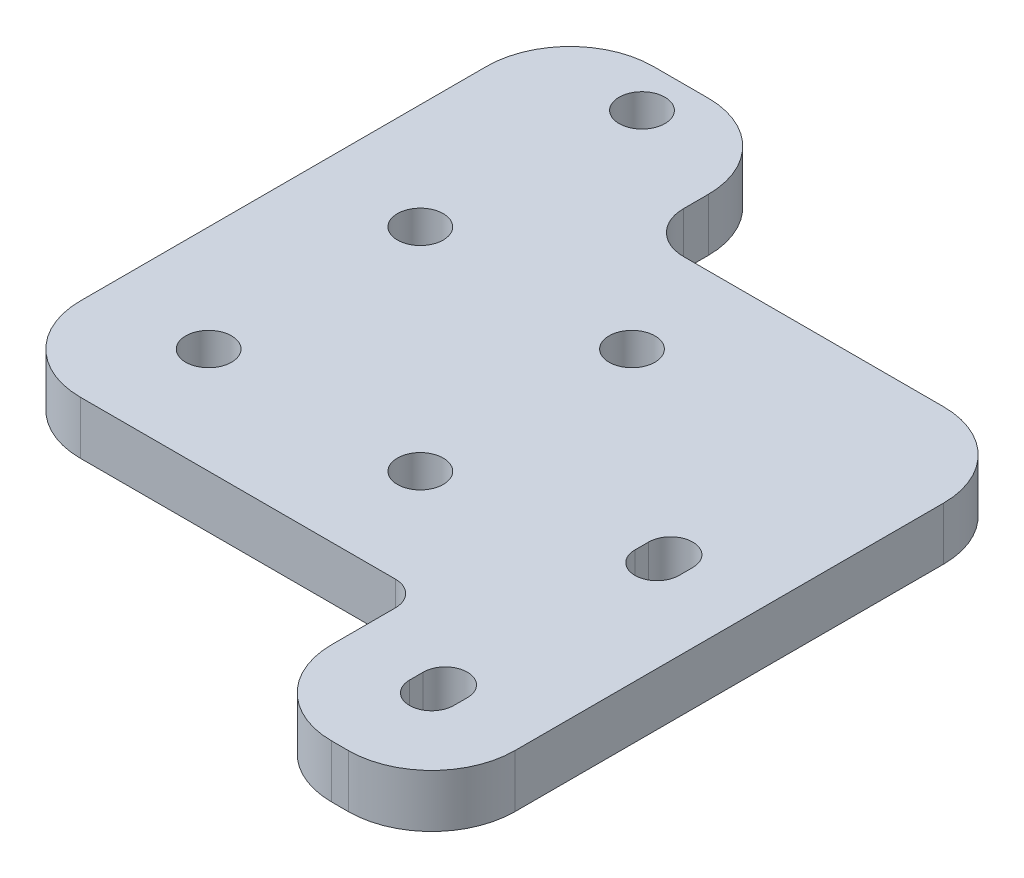
ISO-10303-21;
HEADER;
FILE_DESCRIPTION(('STEP AP214'),'2;1');
FILE_NAME('part.step','',(''),(''),'','','');
FILE_SCHEMA(('AUTOMOTIVE_DESIGN { 1 0 10303 214 1 1 1 1 }'));
ENDSEC;
DATA;
#1=APPLICATION_CONTEXT('core data for automotive mechanical design processes');
#2=APPLICATION_PROTOCOL_DEFINITION('international standard','automotive_design',2000,#1);
#3=PRODUCT_CONTEXT('',#1,'mechanical');
#4=PRODUCT('Part','Part','',(#3));
#5=PRODUCT_RELATED_PRODUCT_CATEGORY('part','',(#4));
#6=PRODUCT_DEFINITION_FORMATION('','',#4);
#7=PRODUCT_DEFINITION_CONTEXT('part definition',#1,'design');
#8=PRODUCT_DEFINITION('design','',#6,#7);
#9=PRODUCT_DEFINITION_SHAPE('','',#8);
#10=(LENGTH_UNIT() NAMED_UNIT(*) SI_UNIT(.MILLI.,.METRE.));
#11=(NAMED_UNIT(*) PLANE_ANGLE_UNIT() SI_UNIT($,.RADIAN.));
#12=(NAMED_UNIT(*) SI_UNIT($,.STERADIAN.) SOLID_ANGLE_UNIT());
#13=UNCERTAINTY_MEASURE_WITH_UNIT(LENGTH_MEASURE(1.E-05),#10,'distance_accuracy_value','');
#14=(GEOMETRIC_REPRESENTATION_CONTEXT(3) GLOBAL_UNCERTAINTY_ASSIGNED_CONTEXT((#13)) GLOBAL_UNIT_ASSIGNED_CONTEXT((#10,
#11,#12)) REPRESENTATION_CONTEXT('',''));
#15=CARTESIAN_POINT('',(0.,0.,0.));
#16=DIRECTION('',(0.,0.,1.));
#17=DIRECTION('',(1.,0.,0.));
#18=AXIS2_PLACEMENT_3D('',#15,#16,#17);
#19=CARTESIAN_POINT('',(-25.4,6.35,25.4));
#20=DIRECTION('',(1.,0.,0.));
#21=DIRECTION('',(0.,0.,-1.));
#22=AXIS2_PLACEMENT_3D('',#19,#20,#21);
#23=PLANE('',#22);
#24=DIRECTION('',(0.,0.,1.));
#25=VECTOR('',#24,1.);
#26=CARTESIAN_POINT('',(-25.4,6.35,-25.4));
#27=LINE('',#26,#25);
#28=CARTESIAN_POINT('',(-25.4,6.35,-33.35));
#29=VERTEX_POINT('',#28);
#30=CARTESIAN_POINT('',(-25.4,6.35,15.4));
#31=VERTEX_POINT('',#30);
#32=EDGE_CURVE('E299',#29,#31,#27,.T.);
#33=ORIENTED_EDGE('',*,*,#32,.F.);
#34=DIRECTION('',(0.,-1.,0.));
#35=VECTOR('',#34,1.);
#36=CARTESIAN_POINT('',(-25.4,6.35,-33.35));
#37=LINE('',#36,#35);
#38=CARTESIAN_POINT('',(-25.4,0.,-33.35));
#39=VERTEX_POINT('',#38);
#40=EDGE_CURVE('E376',#29,#39,#37,.T.);
#41=ORIENTED_EDGE('',*,*,#40,.T.);
#42=DIRECTION('',(0.,0.,1.));
#43=VECTOR('',#42,1.);
#44=CARTESIAN_POINT('',(-25.4,0.,25.4));
#45=LINE('',#44,#43);
#46=CARTESIAN_POINT('',(-25.4,0.,15.4));
#47=VERTEX_POINT('',#46);
#48=EDGE_CURVE('E298',#39,#47,#45,.T.);
#49=ORIENTED_EDGE('',*,*,#48,.T.);
#50=DIRECTION('',(0.,-1.,0.));
#51=VECTOR('',#50,1.);
#52=CARTESIAN_POINT('',(-25.4,6.35,15.4));
#53=LINE('',#52,#51);
#54=EDGE_CURVE('E374',#47,#31,#53,.F.);
#55=ORIENTED_EDGE('',*,*,#54,.T.);
#56=EDGE_LOOP('',(#33,#41,#49,#55));
#57=FACE_BOUND('',#56,.T.);
#58=ADVANCED_FACE('F32',(#57),#23,.F.);
#59=CARTESIAN_POINT('',(25.4,6.35,25.4));
#60=DIRECTION('',(0.,0.,-1.));
#61=DIRECTION('',(-1.,0.,0.));
#62=AXIS2_PLACEMENT_3D('',#59,#60,#61);
#63=PLANE('',#62);
#64=DIRECTION('',(1.,0.,0.));
#65=VECTOR('',#64,1.);
#66=CARTESIAN_POINT('',(25.4,0.,25.4));
#67=LINE('',#66,#65);
#68=CARTESIAN_POINT('',(-15.4,0.,25.4));
#69=VERTEX_POINT('',#68);
#70=CARTESIAN_POINT('',(22.4,0.,25.4));
#71=VERTEX_POINT('',#70);
#72=EDGE_CURVE('E324',#69,#71,#67,.T.);
#73=ORIENTED_EDGE('',*,*,#72,.T.);
#74=DIRECTION('',(0.,-1.,0.));
#75=VECTOR('',#74,1.);
#76=CARTESIAN_POINT('',(22.4,6.35,25.4));
#77=LINE('',#76,#75);
#78=CARTESIAN_POINT('',(22.4,6.35,25.4));
#79=VERTEX_POINT('',#78);
#80=EDGE_CURVE('E401',#71,#79,#77,.F.);
#81=ORIENTED_EDGE('',*,*,#80,.T.);
#82=DIRECTION('',(1.,0.,0.));
#83=VECTOR('',#82,1.);
#84=CARTESIAN_POINT('',(25.4,6.35,25.4));
#85=LINE('',#84,#83);
#86=CARTESIAN_POINT('',(-15.4,6.35,25.4));
#87=VERTEX_POINT('',#86);
#88=EDGE_CURVE('E302',#87,#79,#85,.T.);
#89=ORIENTED_EDGE('',*,*,#88,.F.);
#90=DIRECTION('',(0.,-1.,0.));
#91=VECTOR('',#90,1.);
#92=CARTESIAN_POINT('',(-15.4,6.35,25.4));
#93=LINE('',#92,#91);
#94=EDGE_CURVE('E392',#87,#69,#93,.T.);
#95=ORIENTED_EDGE('',*,*,#94,.T.);
#96=EDGE_LOOP('',(#73,#81,#89,#95));
#97=FACE_BOUND('',#96,.T.);
#98=ADVANCED_FACE('F444',(#97),#63,.F.);
#99=CARTESIAN_POINT('',(25.4,6.35,25.4));
#100=DIRECTION('',(1.,0.,0.));
#101=DIRECTION('',(0.,0.,-1.));
#102=AXIS2_PLACEMENT_3D('',#99,#100,#101);
#103=PLANE('',#102);
#104=DIRECTION('',(0.,0.,1.));
#105=VECTOR('',#104,1.);
#106=CARTESIAN_POINT('',(25.4,6.35,25.4));
#107=LINE('',#106,#105);
#108=CARTESIAN_POINT('',(25.4,6.35,28.4));
#109=VERTEX_POINT('',#108);
#110=CARTESIAN_POINT('',(25.4,6.35,36.04));
#111=VERTEX_POINT('',#110);
#112=EDGE_CURVE('E306',#109,#111,#107,.T.);
#113=ORIENTED_EDGE('',*,*,#112,.F.);
#114=DIRECTION('',(0.,-1.,0.));
#115=VECTOR('',#114,1.);
#116=CARTESIAN_POINT('',(25.4,0.,28.4));
#117=LINE('',#116,#115);
#118=CARTESIAN_POINT('',(25.4,0.,28.4));
#119=VERTEX_POINT('',#118);
#120=EDGE_CURVE('E398',#109,#119,#117,.T.);
#121=ORIENTED_EDGE('',*,*,#120,.T.);
#122=DIRECTION('',(0.,0.,1.));
#123=VECTOR('',#122,1.);
#124=CARTESIAN_POINT('',(25.4,0.,25.4));
#125=LINE('',#124,#123);
#126=CARTESIAN_POINT('',(25.4,0.,36.04));
#127=VERTEX_POINT('',#126);
#128=EDGE_CURVE('E327',#119,#127,#125,.T.);
#129=ORIENTED_EDGE('',*,*,#128,.T.);
#130=DIRECTION('',(0.,-1.,0.));
#131=VECTOR('',#130,1.);
#132=CARTESIAN_POINT('',(25.4,6.35,36.04));
#133=LINE('',#132,#131);
#134=EDGE_CURVE('E359',#127,#111,#133,.F.);
#135=ORIENTED_EDGE('',*,*,#134,.T.);
#136=EDGE_LOOP('',(#113,#121,#129,#135));
#137=FACE_BOUND('',#136,.T.);
#138=ADVANCED_FACE('F452',(#137),#103,.F.);
#139=CARTESIAN_POINT('',(36.4,6.35,46.04));
#140=DIRECTION('',(0.,0.,-1.));
#141=DIRECTION('',(-1.,0.,0.));
#142=AXIS2_PLACEMENT_3D('',#139,#140,#141);
#143=PLANE('',#142);
#144=DIRECTION('',(1.,0.,0.));
#145=VECTOR('',#144,1.);
#146=CARTESIAN_POINT('',(25.4,6.35,46.04));
#147=LINE('',#146,#145);
#148=CARTESIAN_POINT('',(35.4,6.35,46.04));
#149=VERTEX_POINT('',#148);
#150=CARTESIAN_POINT('',(37.4,6.35,46.04));
#151=VERTEX_POINT('',#150);
#152=EDGE_CURVE('E308',#149,#151,#147,.T.);
#153=ORIENTED_EDGE('',*,*,#152,.F.);
#154=DIRECTION('',(0.,-1.,0.));
#155=VECTOR('',#154,1.);
#156=CARTESIAN_POINT('',(35.4,6.35,46.04));
#157=LINE('',#156,#155);
#158=CARTESIAN_POINT('',(35.4,0.,46.04));
#159=VERTEX_POINT('',#158);
#160=EDGE_CURVE('E342',#149,#159,#157,.T.);
#161=ORIENTED_EDGE('',*,*,#160,.T.);
#162=DIRECTION('',(1.,0.,0.));
#163=VECTOR('',#162,1.);
#164=CARTESIAN_POINT('',(36.4,0.,46.04));
#165=LINE('',#164,#163);
#166=CARTESIAN_POINT('',(37.4,0.,46.04));
#167=VERTEX_POINT('',#166);
#168=EDGE_CURVE('E329',#159,#167,#165,.T.);
#169=ORIENTED_EDGE('',*,*,#168,.T.);
#170=DIRECTION('',(0.,-1.,0.));
#171=VECTOR('',#170,1.);
#172=CARTESIAN_POINT('',(37.4,6.35,46.04));
#173=LINE('',#172,#171);
#174=EDGE_CURVE('E321',#167,#151,#173,.F.);
#175=ORIENTED_EDGE('',*,*,#174,.T.);
#176=EDGE_LOOP('',(#153,#161,#169,#175));
#177=FACE_BOUND('',#176,.T.);
#178=ADVANCED_FACE('F462',(#177),#143,.F.);
#179=CARTESIAN_POINT('',(47.4,6.35,46.04));
#180=DIRECTION('',(-1.,0.,0.));
#181=DIRECTION('',(0.,0.,1.));
#182=AXIS2_PLACEMENT_3D('',#179,#180,#181);
#183=PLANE('',#182);
#184=DIRECTION('',(0.,0.,-1.));
#185=VECTOR('',#184,1.);
#186=CARTESIAN_POINT('',(47.4,6.35,46.04));
#187=LINE('',#186,#185);
#188=CARTESIAN_POINT('',(47.4,6.35,36.04));
#189=VERTEX_POINT('',#188);
#190=CARTESIAN_POINT('',(47.4,6.35,-15.4));
#191=VERTEX_POINT('',#190);
#192=EDGE_CURVE('E311',#189,#191,#187,.T.);
#193=ORIENTED_EDGE('',*,*,#192,.F.);
#194=DIRECTION('',(0.,-1.,0.));
#195=VECTOR('',#194,1.);
#196=CARTESIAN_POINT('',(47.4,6.35,36.04));
#197=LINE('',#196,#195);
#198=CARTESIAN_POINT('',(47.4,0.,36.04));
#199=VERTEX_POINT('',#198);
#200=EDGE_CURVE('E389',#189,#199,#197,.T.);
#201=ORIENTED_EDGE('',*,*,#200,.T.);
#202=DIRECTION('',(0.,0.,-1.));
#203=VECTOR('',#202,1.);
#204=CARTESIAN_POINT('',(47.4,0.,46.04));
#205=LINE('',#204,#203);
#206=CARTESIAN_POINT('',(47.4,0.,-15.4));
#207=VERTEX_POINT('',#206);
#208=EDGE_CURVE('E332',#199,#207,#205,.T.);
#209=ORIENTED_EDGE('',*,*,#208,.T.);
#210=DIRECTION('',(0.,-1.,0.));
#211=VECTOR('',#210,1.);
#212=CARTESIAN_POINT('',(47.4,6.35,-15.4));
#213=LINE('',#212,#211);
#214=EDGE_CURVE('E387',#207,#191,#213,.F.);
#215=ORIENTED_EDGE('',*,*,#214,.T.);
#216=EDGE_LOOP('',(#193,#201,#209,#215));
#217=FACE_BOUND('',#216,.T.);
#218=ADVANCED_FACE('F470',(#217),#183,.F.);
#219=CARTESIAN_POINT('',(1.2,6.35,-25.4));
#220=DIRECTION('',(0.,0.,1.));
#221=DIRECTION('',(1.,0.,0.));
#222=AXIS2_PLACEMENT_3D('',#219,#220,#221);
#223=PLANE('',#222);
#224=DIRECTION('',(-1.,0.,0.));
#225=VECTOR('',#224,1.);
#226=CARTESIAN_POINT('',(1.2,0.,-25.4));
#227=LINE('',#226,#225);
#228=CARTESIAN_POINT('',(37.4,0.,-25.4));
#229=VERTEX_POINT('',#228);
#230=CARTESIAN_POINT('',(6.2,0.,-25.4));
#231=VERTEX_POINT('',#230);
#232=EDGE_CURVE('E335',#229,#231,#227,.T.);
#233=ORIENTED_EDGE('',*,*,#232,.T.);
#234=DIRECTION('',(0.,-1.,0.));
#235=VECTOR('',#234,1.);
#236=CARTESIAN_POINT('',(6.2,6.35,-25.4));
#237=LINE('',#236,#235);
#238=CARTESIAN_POINT('',(6.2,6.35,-25.4));
#239=VERTEX_POINT('',#238);
#240=EDGE_CURVE('E53',#231,#239,#237,.F.);
#241=ORIENTED_EDGE('',*,*,#240,.T.);
#242=DIRECTION('',(-1.,0.,0.));
#243=VECTOR('',#242,1.);
#244=CARTESIAN_POINT('',(47.4,6.35,-25.4));
#245=LINE('',#244,#243);
#246=CARTESIAN_POINT('',(37.4,6.35,-25.4));
#247=VERTEX_POINT('',#246);
#248=EDGE_CURVE('E314',#247,#239,#245,.T.);
#249=ORIENTED_EDGE('',*,*,#248,.F.);
#250=DIRECTION('',(0.,-1.,0.));
#251=VECTOR('',#250,1.);
#252=CARTESIAN_POINT('',(37.4,6.35,-25.4));
#253=LINE('',#252,#251);
#254=EDGE_CURVE('E395',#247,#229,#253,.T.);
#255=ORIENTED_EDGE('',*,*,#254,.T.);
#256=EDGE_LOOP('',(#233,#241,#249,#255));
#257=FACE_BOUND('',#256,.T.);
#258=ADVANCED_FACE('F476',(#257),#223,.F.);
#259=CARTESIAN_POINT('',(1.2,6.35,-43.35));
#260=DIRECTION('',(-1.,0.,0.));
#261=DIRECTION('',(0.,0.,1.));
#262=AXIS2_PLACEMENT_3D('',#259,#260,#261);
#263=PLANE('',#262);
#264=DIRECTION('',(0.,0.,-1.));
#265=VECTOR('',#264,1.);
#266=CARTESIAN_POINT('',(1.2,6.35,-43.35));
#267=LINE('',#266,#265);
#268=CARTESIAN_POINT('',(1.2,6.35,-30.4));
#269=VERTEX_POINT('',#268);
#270=CARTESIAN_POINT('',(1.2,6.35,-33.35));
#271=VERTEX_POINT('',#270);
#272=EDGE_CURVE('E316',#269,#271,#267,.T.);
#273=ORIENTED_EDGE('',*,*,#272,.F.);
#274=DIRECTION('',(0.,-1.,0.));
#275=VECTOR('',#274,1.);
#276=CARTESIAN_POINT('',(1.2,0.,-30.4));
#277=LINE('',#276,#275);
#278=CARTESIAN_POINT('',(1.2,0.,-30.4));
#279=VERTEX_POINT('',#278);
#280=EDGE_CURVE('E407',#269,#279,#277,.T.);
#281=ORIENTED_EDGE('',*,*,#280,.T.);
#282=DIRECTION('',(0.,0.,-1.));
#283=VECTOR('',#282,1.);
#284=CARTESIAN_POINT('',(1.2,0.,-43.35));
#285=LINE('',#284,#283);
#286=CARTESIAN_POINT('',(1.2,0.,-33.35));
#287=VERTEX_POINT('',#286);
#288=EDGE_CURVE('E337',#279,#287,#285,.T.);
#289=ORIENTED_EDGE('',*,*,#288,.T.);
#290=DIRECTION('',(0.,-1.,0.));
#291=VECTOR('',#290,1.);
#292=CARTESIAN_POINT('',(1.2,6.35,-33.35));
#293=LINE('',#292,#291);
#294=EDGE_CURVE('E384',#287,#271,#293,.F.);
#295=ORIENTED_EDGE('',*,*,#294,.T.);
#296=EDGE_LOOP('',(#273,#281,#289,#295));
#297=FACE_BOUND('',#296,.T.);
#298=ADVANCED_FACE('F413',(#297),#263,.F.);
#299=CARTESIAN_POINT('',(-25.4,6.35,-43.35));
#300=DIRECTION('',(0.,0.,1.));
#301=DIRECTION('',(1.,0.,0.));
#302=AXIS2_PLACEMENT_3D('',#299,#300,#301);
#303=PLANE('',#302);
#304=DIRECTION('',(-1.,0.,0.));
#305=VECTOR('',#304,1.);
#306=CARTESIAN_POINT('',(-25.4,0.,-43.35));
#307=LINE('',#306,#305);
#308=CARTESIAN_POINT('',(-8.8,0.,-43.35));
#309=VERTEX_POINT('',#308);
#310=CARTESIAN_POINT('',(-15.4,0.,-43.35));
#311=VERTEX_POINT('',#310);
#312=EDGE_CURVE('E303',#309,#311,#307,.T.);
#313=ORIENTED_EDGE('',*,*,#312,.T.);
#314=DIRECTION('',(0.,-1.,0.));
#315=VECTOR('',#314,1.);
#316=CARTESIAN_POINT('',(-15.4,6.35,-43.35));
#317=LINE('',#316,#315);
#318=CARTESIAN_POINT('',(-15.4,6.35,-43.35));
#319=VERTEX_POINT('',#318);
#320=EDGE_CURVE('E382',#311,#319,#317,.F.);
#321=ORIENTED_EDGE('',*,*,#320,.T.);
#322=DIRECTION('',(-1.,0.,0.));
#323=VECTOR('',#322,1.);
#324=CARTESIAN_POINT('',(-25.4,6.35,-43.35));
#325=LINE('',#324,#323);
#326=CARTESIAN_POINT('',(-8.8,6.35,-43.35));
#327=VERTEX_POINT('',#326);
#328=EDGE_CURVE('E318',#327,#319,#325,.T.);
#329=ORIENTED_EDGE('',*,*,#328,.F.);
#330=DIRECTION('',(0.,-1.,0.));
#331=VECTOR('',#330,1.);
#332=CARTESIAN_POINT('',(-8.8,6.35,-43.35));
#333=LINE('',#332,#331);
#334=EDGE_CURVE('E379',#327,#309,#333,.T.);
#335=ORIENTED_EDGE('',*,*,#334,.T.);
#336=EDGE_LOOP('',(#313,#321,#329,#335));
#337=FACE_BOUND('',#336,.T.);
#338=ADVANCED_FACE('F428',(#337),#303,.F.);
#339=CARTESIAN_POINT('',(0.,6.35,0.));
#340=DIRECTION('',(0.,-1.,0.));
#341=DIRECTION('',(0.,0.,-1.));
#342=AXIS2_PLACEMENT_3D('',#339,#340,#341);
#343=PLANE('',#342);
#344=DIRECTION('',(0.,0.,1.));
#345=VECTOR('',#344,1.);
#346=CARTESIAN_POINT('',(33.75,6.35,6.36));
#347=LINE('',#346,#345);
#348=CARTESIAN_POINT('',(33.75,6.35,6.36));
#349=VERTEX_POINT('',#348);
#350=CARTESIAN_POINT('',(33.75,6.35,8.00000000000001));
#351=VERTEX_POINT('',#350);
#352=EDGE_CURVE('E227',#349,#351,#347,.T.);
#353=ORIENTED_EDGE('',*,*,#352,.F.);
#354=CARTESIAN_POINT('',(36.4,6.35,6.36));
#355=DIRECTION('',(0.,1.,0.));
#356=DIRECTION('',(0.,0.,-1.));
#357=AXIS2_PLACEMENT_3D('',#354,#355,#356);
#358=CIRCLE('',#357,2.65);
#359=CARTESIAN_POINT('',(39.05,6.35,6.36));
#360=VERTEX_POINT('',#359);
#361=EDGE_CURVE('E200',#360,#349,#358,.T.);
#362=ORIENTED_EDGE('',*,*,#361,.F.);
#363=DIRECTION('',(0.,0.,-1.));
#364=VECTOR('',#363,1.);
#365=CARTESIAN_POINT('',(39.05,6.35,6.36));
#366=LINE('',#365,#364);
#367=CARTESIAN_POINT('',(39.05,6.35,8.00000000000001));
#368=VERTEX_POINT('',#367);
#369=EDGE_CURVE('E218',#368,#360,#366,.T.);
#370=ORIENTED_EDGE('',*,*,#369,.F.);
#371=CARTESIAN_POINT('',(36.4,6.35,8.00000000000001));
#372=DIRECTION('',(0.,1.,0.));
#373=DIRECTION('',(0.,0.,1.));
#374=AXIS2_PLACEMENT_3D('',#371,#372,#373);
#375=CIRCLE('',#374,2.65);
#376=EDGE_CURVE('E221',#351,#368,#375,.T.);
#377=ORIENTED_EDGE('',*,*,#376,.F.);
#378=EDGE_LOOP('',(#353,#362,#370,#377));
#379=FACE_BOUND('',#378,.T.);
#380=DIRECTION('',(0.,0.,1.));
#381=VECTOR('',#380,1.);
#382=CARTESIAN_POINT('',(33.75,6.35,33.4));
#383=LINE('',#382,#381);
#384=CARTESIAN_POINT('',(33.75,6.35,33.4));
#385=VERTEX_POINT('',#384);
#386=CARTESIAN_POINT('',(33.75,6.35,35.04));
#387=VERTEX_POINT('',#386);
#388=EDGE_CURVE('E252',#385,#387,#383,.T.);
#389=ORIENTED_EDGE('',*,*,#388,.F.);
#390=CARTESIAN_POINT('',(36.4,6.35,33.4));
#391=DIRECTION('',(0.,1.,0.));
#392=DIRECTION('',(0.,0.,-1.));
#393=AXIS2_PLACEMENT_3D('',#390,#391,#392);
#394=CIRCLE('',#393,2.65);
#395=CARTESIAN_POINT('',(39.05,6.35,33.4));
#396=VERTEX_POINT('',#395);
#397=EDGE_CURVE('E233',#396,#385,#394,.T.);
#398=ORIENTED_EDGE('',*,*,#397,.F.);
#399=DIRECTION('',(0.,0.,-1.));
#400=VECTOR('',#399,1.);
#401=CARTESIAN_POINT('',(39.05,6.35,33.4));
#402=LINE('',#401,#400);
#403=CARTESIAN_POINT('',(39.05,6.35,35.04));
#404=VERTEX_POINT('',#403);
#405=EDGE_CURVE('E241',#404,#396,#402,.T.);
#406=ORIENTED_EDGE('',*,*,#405,.F.);
#407=CARTESIAN_POINT('',(36.4,6.35,35.04));
#408=DIRECTION('',(0.,1.,0.));
#409=DIRECTION('',(0.,0.,1.));
#410=AXIS2_PLACEMENT_3D('',#407,#408,#409);
#411=CIRCLE('',#410,2.65);
#412=EDGE_CURVE('E255',#387,#404,#411,.T.);
#413=ORIENTED_EDGE('',*,*,#412,.F.);
#414=EDGE_LOOP('',(#389,#398,#406,#413));
#415=FACE_BOUND('',#414,.T.);
#416=CARTESIAN_POINT('',(-12.7,6.35,-12.7));
#417=DIRECTION('',(0.,1.,0.));
#418=DIRECTION('',(0.,0.,1.));
#419=AXIS2_PLACEMENT_3D('',#416,#417,#418);
#420=CIRCLE('',#419,2.74999999999999);
#421=CARTESIAN_POINT('',(-12.7,6.35,-9.95000000000001));
#422=VERTEX_POINT('',#421);
#423=EDGE_CURVE('E262',#422,#422,#420,.T.);
#424=ORIENTED_EDGE('',*,*,#423,.F.);
#425=EDGE_LOOP('',(#424));
#426=FACE_BOUND('',#425,.T.);
#427=CARTESIAN_POINT('',(12.7,6.35,-12.7));
#428=DIRECTION('',(0.,1.,0.));
#429=DIRECTION('',(0.,0.,1.));
#430=AXIS2_PLACEMENT_3D('',#427,#428,#429);
#431=CIRCLE('',#430,2.74999999999999);
#432=CARTESIAN_POINT('',(12.7,6.35,-9.95000000000001));
#433=VERTEX_POINT('',#432);
#434=EDGE_CURVE('E274',#433,#433,#431,.T.);
#435=ORIENTED_EDGE('',*,*,#434,.F.);
#436=EDGE_LOOP('',(#435));
#437=FACE_BOUND('',#436,.T.);
#438=CARTESIAN_POINT('',(12.7,6.35,12.7));
#439=DIRECTION('',(0.,1.,0.));
#440=DIRECTION('',(0.,0.,1.));
#441=AXIS2_PLACEMENT_3D('',#438,#439,#440);
#442=CIRCLE('',#441,2.74999999999999);
#443=CARTESIAN_POINT('',(12.7,6.35,15.45));
#444=VERTEX_POINT('',#443);
#445=EDGE_CURVE('E280',#444,#444,#442,.T.);
#446=ORIENTED_EDGE('',*,*,#445,.F.);
#447=EDGE_LOOP('',(#446));
#448=FACE_BOUND('',#447,.T.);
#449=CARTESIAN_POINT('',(-12.7,6.35,12.7));
#450=DIRECTION('',(0.,1.,0.));
#451=DIRECTION('',(0.,0.,1.));
#452=AXIS2_PLACEMENT_3D('',#449,#450,#451);
#453=CIRCLE('',#452,2.74999999999999);
#454=CARTESIAN_POINT('',(-12.7,6.35,15.45));
#455=VERTEX_POINT('',#454);
#456=EDGE_CURVE('E286',#455,#455,#453,.T.);
#457=ORIENTED_EDGE('',*,*,#456,.F.);
#458=EDGE_LOOP('',(#457));
#459=FACE_BOUND('',#458,.T.);
#460=CARTESIAN_POINT('',(-11.5,6.35,-38.1));
#461=DIRECTION('',(0.,1.,0.));
#462=DIRECTION('',(0.,0.,1.));
#463=AXIS2_PLACEMENT_3D('',#460,#461,#462);
#464=CIRCLE('',#463,2.74999999999999);
#465=CARTESIAN_POINT('',(-11.5,6.35,-35.35));
#466=VERTEX_POINT('',#465);
#467=EDGE_CURVE('E292',#466,#466,#464,.T.);
#468=ORIENTED_EDGE('',*,*,#467,.F.);
#469=EDGE_LOOP('',(#468));
#470=FACE_BOUND('',#469,.T.);
#471=ORIENTED_EDGE('',*,*,#88,.T.);
#472=CARTESIAN_POINT('',(22.4,6.35,28.4));
#473=DIRECTION('',(0.,-1.,0.));
#474=DIRECTION('',(0.,0.,-1.));
#475=AXIS2_PLACEMENT_3D('',#472,#473,#474);
#476=CIRCLE('',#475,3.);
#477=EDGE_CURVE('E405',#79,#109,#476,.T.);
#478=ORIENTED_EDGE('',*,*,#477,.T.);
#479=ORIENTED_EDGE('',*,*,#112,.T.);
#480=CARTESIAN_POINT('',(35.4,6.35,36.04));
#481=DIRECTION('',(0.,-1.,0.));
#482=DIRECTION('',(0.,0.,-1.));
#483=AXIS2_PLACEMENT_3D('',#480,#481,#482);
#484=CIRCLE('',#483,10.);
#485=EDGE_CURVE('E372',#111,#149,#484,.F.);
#486=ORIENTED_EDGE('',*,*,#485,.T.);
#487=ORIENTED_EDGE('',*,*,#152,.T.);
#488=CARTESIAN_POINT('',(37.4,6.35,36.04));
#489=DIRECTION('',(0.,-1.,0.));
#490=DIRECTION('',(0.,0.,-1.));
#491=AXIS2_PLACEMENT_3D('',#488,#489,#490);
#492=CIRCLE('',#491,10.);
#493=EDGE_CURVE('E366',#151,#189,#492,.F.);
#494=ORIENTED_EDGE('',*,*,#493,.T.);
#495=ORIENTED_EDGE('',*,*,#192,.T.);
#496=CARTESIAN_POINT('',(37.4,6.35,-15.4));
#497=DIRECTION('',(0.,-1.,0.));
#498=DIRECTION('',(0.,0.,-1.));
#499=AXIS2_PLACEMENT_3D('',#496,#497,#498);
#500=CIRCLE('',#499,10.);
#501=EDGE_CURVE('E362',#191,#247,#500,.F.);
#502=ORIENTED_EDGE('',*,*,#501,.T.);
#503=ORIENTED_EDGE('',*,*,#248,.T.);
#504=CARTESIAN_POINT('',(6.2,6.35,-30.4));
#505=DIRECTION('',(0.,-1.,0.));
#506=DIRECTION('',(0.,0.,-1.));
#507=AXIS2_PLACEMENT_3D('',#504,#505,#506);
#508=CIRCLE('',#507,5.);
#509=EDGE_CURVE('E11',#239,#269,#508,.T.);
#510=ORIENTED_EDGE('',*,*,#509,.T.);
#511=ORIENTED_EDGE('',*,*,#272,.T.);
#512=CARTESIAN_POINT('',(-8.8,6.35,-33.35));
#513=DIRECTION('',(0.,-1.,0.));
#514=DIRECTION('',(0.,0.,-1.));
#515=AXIS2_PLACEMENT_3D('',#512,#513,#514);
#516=CIRCLE('',#515,10.);
#517=EDGE_CURVE('E368',#271,#327,#516,.F.);
#518=ORIENTED_EDGE('',*,*,#517,.T.);
#519=ORIENTED_EDGE('',*,*,#328,.T.);
#520=CARTESIAN_POINT('',(-15.4,6.35,-33.35));
#521=DIRECTION('',(0.,-1.,0.));
#522=DIRECTION('',(0.,0.,-1.));
#523=AXIS2_PLACEMENT_3D('',#520,#521,#522);
#524=CIRCLE('',#523,10.);
#525=EDGE_CURVE('E370',#319,#29,#524,.F.);
#526=ORIENTED_EDGE('',*,*,#525,.T.);
#527=ORIENTED_EDGE('',*,*,#32,.T.);
#528=CARTESIAN_POINT('',(-15.4,6.35,15.4));
#529=DIRECTION('',(0.,-1.,0.));
#530=DIRECTION('',(0.,0.,-1.));
#531=AXIS2_PLACEMENT_3D('',#528,#529,#530);
#532=CIRCLE('',#531,10.);
#533=EDGE_CURVE('E364',#31,#87,#532,.F.);
#534=ORIENTED_EDGE('',*,*,#533,.T.);
#535=EDGE_LOOP('',(#471,#478,#479,#486,#487,#494,#495,#502,#503,#510,#511,#518,#519,#526,#527,#534));
#536=FACE_BOUND('',#535,.T.);
#537=ADVANCED_FACE('F425',(#379,#415,#426,#437,#448,#459,#470,#536),#343,.F.);
#538=CARTESIAN_POINT('',(0.,0.,0.));
#539=DIRECTION('',(0.,-1.,0.));
#540=DIRECTION('',(0.,0.,-1.));
#541=AXIS2_PLACEMENT_3D('',#538,#539,#540);
#542=PLANE('',#541);
#543=CARTESIAN_POINT('',(36.4,0.,6.36));
#544=DIRECTION('',(0.,1.,0.));
#545=DIRECTION('',(0.,0.,-1.));
#546=AXIS2_PLACEMENT_3D('',#543,#544,#545);
#547=CIRCLE('',#546,2.65);
#548=CARTESIAN_POINT('',(39.05,0.,6.36));
#549=VERTEX_POINT('',#548);
#550=CARTESIAN_POINT('',(33.75,0.,6.36));
#551=VERTEX_POINT('',#550);
#552=EDGE_CURVE('E197',#549,#551,#547,.T.);
#553=ORIENTED_EDGE('',*,*,#552,.T.);
#554=DIRECTION('',(0.,0.,1.));
#555=VECTOR('',#554,1.);
#556=CARTESIAN_POINT('',(33.75,0.,6.36));
#557=LINE('',#556,#555);
#558=CARTESIAN_POINT('',(33.75,0.,8.00000000000001));
#559=VERTEX_POINT('',#558);
#560=EDGE_CURVE('E209',#551,#559,#557,.T.);
#561=ORIENTED_EDGE('',*,*,#560,.T.);
#562=CARTESIAN_POINT('',(36.4,0.,8.00000000000001));
#563=DIRECTION('',(0.,1.,0.));
#564=DIRECTION('',(0.,0.,1.));
#565=AXIS2_PLACEMENT_3D('',#562,#563,#564);
#566=CIRCLE('',#565,2.65);
#567=CARTESIAN_POINT('',(39.05,0.,8.00000000000001));
#568=VERTEX_POINT('',#567);
#569=EDGE_CURVE('E213',#559,#568,#566,.T.);
#570=ORIENTED_EDGE('',*,*,#569,.T.);
#571=DIRECTION('',(0.,0.,-1.));
#572=VECTOR('',#571,1.);
#573=CARTESIAN_POINT('',(39.05,0.,6.36));
#574=LINE('',#573,#572);
#575=EDGE_CURVE('E205',#568,#549,#574,.T.);
#576=ORIENTED_EDGE('',*,*,#575,.T.);
#577=EDGE_LOOP('',(#553,#561,#570,#576));
#578=FACE_BOUND('',#577,.T.);
#579=CARTESIAN_POINT('',(36.4,0.,33.4));
#580=DIRECTION('',(0.,1.,0.));
#581=DIRECTION('',(0.,0.,-1.));
#582=AXIS2_PLACEMENT_3D('',#579,#580,#581);
#583=CIRCLE('',#582,2.65);
#584=CARTESIAN_POINT('',(39.05,0.,33.4));
#585=VERTEX_POINT('',#584);
#586=CARTESIAN_POINT('',(33.75,0.,33.4));
#587=VERTEX_POINT('',#586);
#588=EDGE_CURVE('E237',#585,#587,#583,.T.);
#589=ORIENTED_EDGE('',*,*,#588,.T.);
#590=DIRECTION('',(0.,0.,1.));
#591=VECTOR('',#590,1.);
#592=CARTESIAN_POINT('',(33.75,0.,33.4));
#593=LINE('',#592,#591);
#594=CARTESIAN_POINT('',(33.75,0.,35.04));
#595=VERTEX_POINT('',#594);
#596=EDGE_CURVE('E240',#587,#595,#593,.T.);
#597=ORIENTED_EDGE('',*,*,#596,.T.);
#598=CARTESIAN_POINT('',(36.4,0.,35.04));
#599=DIRECTION('',(0.,1.,0.));
#600=DIRECTION('',(0.,0.,1.));
#601=AXIS2_PLACEMENT_3D('',#598,#599,#600);
#602=CIRCLE('',#601,2.65);
#603=CARTESIAN_POINT('',(39.05,0.,35.04));
#604=VERTEX_POINT('',#603);
#605=EDGE_CURVE('E244',#595,#604,#602,.T.);
#606=ORIENTED_EDGE('',*,*,#605,.T.);
#607=DIRECTION('',(0.,0.,-1.));
#608=VECTOR('',#607,1.);
#609=CARTESIAN_POINT('',(39.05,0.,33.4));
#610=LINE('',#609,#608);
#611=EDGE_CURVE('E247',#604,#585,#610,.T.);
#612=ORIENTED_EDGE('',*,*,#611,.T.);
#613=EDGE_LOOP('',(#589,#597,#606,#612));
#614=FACE_BOUND('',#613,.T.);
#615=CARTESIAN_POINT('',(-12.7,0.,-12.7));
#616=DIRECTION('',(0.,1.,0.));
#617=DIRECTION('',(0.,0.,1.));
#618=AXIS2_PLACEMENT_3D('',#615,#616,#617);
#619=CIRCLE('',#618,2.74999999999999);
#620=CARTESIAN_POINT('',(-12.7,0.,-9.95000000000001));
#621=VERTEX_POINT('',#620);
#622=EDGE_CURVE('E271',#621,#621,#619,.T.);
#623=ORIENTED_EDGE('',*,*,#622,.T.);
#624=EDGE_LOOP('',(#623));
#625=FACE_BOUND('',#624,.T.);
#626=CARTESIAN_POINT('',(12.7,0.,-12.7));
#627=DIRECTION('',(0.,1.,0.));
#628=DIRECTION('',(0.,0.,1.));
#629=AXIS2_PLACEMENT_3D('',#626,#627,#628);
#630=CIRCLE('',#629,2.74999999999999);
#631=CARTESIAN_POINT('',(12.7,0.,-9.95000000000001));
#632=VERTEX_POINT('',#631);
#633=EDGE_CURVE('E277',#632,#632,#630,.T.);
#634=ORIENTED_EDGE('',*,*,#633,.T.);
#635=EDGE_LOOP('',(#634));
#636=FACE_BOUND('',#635,.T.);
#637=CARTESIAN_POINT('',(12.7,0.,12.7));
#638=DIRECTION('',(0.,1.,0.));
#639=DIRECTION('',(0.,0.,1.));
#640=AXIS2_PLACEMENT_3D('',#637,#638,#639);
#641=CIRCLE('',#640,2.74999999999999);
#642=CARTESIAN_POINT('',(12.7,0.,15.45));
#643=VERTEX_POINT('',#642);
#644=EDGE_CURVE('E283',#643,#643,#641,.T.);
#645=ORIENTED_EDGE('',*,*,#644,.T.);
#646=EDGE_LOOP('',(#645));
#647=FACE_BOUND('',#646,.T.);
#648=CARTESIAN_POINT('',(-12.7,0.,12.7));
#649=DIRECTION('',(0.,1.,0.));
#650=DIRECTION('',(0.,0.,1.));
#651=AXIS2_PLACEMENT_3D('',#648,#649,#650);
#652=CIRCLE('',#651,2.74999999999999);
#653=CARTESIAN_POINT('',(-12.7,0.,15.45));
#654=VERTEX_POINT('',#653);
#655=EDGE_CURVE('E289',#654,#654,#652,.T.);
#656=ORIENTED_EDGE('',*,*,#655,.T.);
#657=EDGE_LOOP('',(#656));
#658=FACE_BOUND('',#657,.T.);
#659=CARTESIAN_POINT('',(-11.5,0.,-38.1));
#660=DIRECTION('',(0.,1.,0.));
#661=DIRECTION('',(0.,0.,1.));
#662=AXIS2_PLACEMENT_3D('',#659,#660,#661);
#663=CIRCLE('',#662,2.74999999999999);
#664=CARTESIAN_POINT('',(-11.5,0.,-35.35));
#665=VERTEX_POINT('',#664);
#666=EDGE_CURVE('E295',#665,#665,#663,.T.);
#667=ORIENTED_EDGE('',*,*,#666,.T.);
#668=EDGE_LOOP('',(#667));
#669=FACE_BOUND('',#668,.T.);
#670=ORIENTED_EDGE('',*,*,#168,.F.);
#671=CARTESIAN_POINT('',(35.4,0.,36.04));
#672=DIRECTION('',(0.,-1.,0.));
#673=DIRECTION('',(0.,0.,-1.));
#674=AXIS2_PLACEMENT_3D('',#671,#672,#673);
#675=CIRCLE('',#674,10.);
#676=EDGE_CURVE('E356',#159,#127,#675,.T.);
#677=ORIENTED_EDGE('',*,*,#676,.T.);
#678=ORIENTED_EDGE('',*,*,#128,.F.);
#679=CARTESIAN_POINT('',(22.4,0.,28.4));
#680=DIRECTION('',(0.,-1.,0.));
#681=DIRECTION('',(0.,0.,-1.));
#682=AXIS2_PLACEMENT_3D('',#679,#680,#681);
#683=CIRCLE('',#682,3.);
#684=EDGE_CURVE('E403',#119,#71,#683,.F.);
#685=ORIENTED_EDGE('',*,*,#684,.T.);
#686=ORIENTED_EDGE('',*,*,#72,.F.);
#687=CARTESIAN_POINT('',(-15.4,0.,15.4));
#688=DIRECTION('',(0.,-1.,0.));
#689=DIRECTION('',(0.,0.,-1.));
#690=AXIS2_PLACEMENT_3D('',#687,#688,#689);
#691=CIRCLE('',#690,10.);
#692=EDGE_CURVE('E347',#69,#47,#691,.T.);
#693=ORIENTED_EDGE('',*,*,#692,.T.);
#694=ORIENTED_EDGE('',*,*,#48,.F.);
#695=CARTESIAN_POINT('',(-15.4,0.,-33.35));
#696=DIRECTION('',(0.,-1.,0.));
#697=DIRECTION('',(0.,0.,-1.));
#698=AXIS2_PLACEMENT_3D('',#695,#696,#697);
#699=CIRCLE('',#698,10.);
#700=EDGE_CURVE('E354',#39,#311,#699,.T.);
#701=ORIENTED_EDGE('',*,*,#700,.T.);
#702=ORIENTED_EDGE('',*,*,#312,.F.);
#703=CARTESIAN_POINT('',(-8.8,0.,-33.35));
#704=DIRECTION('',(0.,-1.,0.));
#705=DIRECTION('',(0.,0.,-1.));
#706=AXIS2_PLACEMENT_3D('',#703,#704,#705);
#707=CIRCLE('',#706,10.);
#708=EDGE_CURVE('E351',#309,#287,#707,.T.);
#709=ORIENTED_EDGE('',*,*,#708,.T.);
#710=ORIENTED_EDGE('',*,*,#288,.F.);
#711=CARTESIAN_POINT('',(6.2,0.,-30.4));
#712=DIRECTION('',(0.,-1.,0.));
#713=DIRECTION('',(0.,0.,-1.));
#714=AXIS2_PLACEMENT_3D('',#711,#712,#713);
#715=CIRCLE('',#714,5.);
#716=EDGE_CURVE('E40',#279,#231,#715,.F.);
#717=ORIENTED_EDGE('',*,*,#716,.T.);
#718=ORIENTED_EDGE('',*,*,#232,.F.);
#719=CARTESIAN_POINT('',(37.4,0.,-15.4));
#720=DIRECTION('',(0.,-1.,0.));
#721=DIRECTION('',(0.,0.,-1.));
#722=AXIS2_PLACEMENT_3D('',#719,#720,#721);
#723=CIRCLE('',#722,10.);
#724=EDGE_CURVE('E345',#229,#207,#723,.T.);
#725=ORIENTED_EDGE('',*,*,#724,.T.);
#726=ORIENTED_EDGE('',*,*,#208,.F.);
#727=CARTESIAN_POINT('',(37.4,0.,36.04));
#728=DIRECTION('',(0.,-1.,0.));
#729=DIRECTION('',(0.,0.,-1.));
#730=AXIS2_PLACEMENT_3D('',#727,#728,#729);
#731=CIRCLE('',#730,10.);
#732=EDGE_CURVE('E349',#199,#167,#731,.T.);
#733=ORIENTED_EDGE('',*,*,#732,.T.);
#734=EDGE_LOOP('',(#670,#677,#678,#685,#686,#693,#694,#701,#702,#709,#710,#717,#718,#725,#726,#733));
#735=FACE_BOUND('',#734,.T.);
#736=ADVANCED_FACE('F215',(#578,#614,#625,#636,#647,#658,#669,#735),#542,.T.);
#737=CARTESIAN_POINT('',(-11.5,6.35,-38.1));
#738=DIRECTION('',(0.,1.,0.));
#739=DIRECTION('',(0.,0.,1.));
#740=AXIS2_PLACEMENT_3D('',#737,#738,#739);
#741=CYLINDRICAL_SURFACE('',#740,2.74999999999999);
#742=ORIENTED_EDGE('',*,*,#666,.F.);
#743=EDGE_LOOP('',(#742));
#744=FACE_BOUND('',#743,.T.);
#745=ORIENTED_EDGE('',*,*,#467,.T.);
#746=EDGE_LOOP('',(#745));
#747=FACE_BOUND('',#746,.T.);
#748=ADVANCED_FACE('F551',(#744,#747),#741,.F.);
#749=CARTESIAN_POINT('',(-12.7,6.35,12.7));
#750=DIRECTION('',(0.,1.,0.));
#751=DIRECTION('',(0.,0.,1.));
#752=AXIS2_PLACEMENT_3D('',#749,#750,#751);
#753=CYLINDRICAL_SURFACE('',#752,2.74999999999999);
#754=ORIENTED_EDGE('',*,*,#655,.F.);
#755=EDGE_LOOP('',(#754));
#756=FACE_BOUND('',#755,.T.);
#757=ORIENTED_EDGE('',*,*,#456,.T.);
#758=EDGE_LOOP('',(#757));
#759=FACE_BOUND('',#758,.T.);
#760=ADVANCED_FACE('F564',(#756,#759),#753,.F.);
#761=CARTESIAN_POINT('',(12.7,6.35,12.7));
#762=DIRECTION('',(0.,1.,0.));
#763=DIRECTION('',(0.,0.,1.));
#764=AXIS2_PLACEMENT_3D('',#761,#762,#763);
#765=CYLINDRICAL_SURFACE('',#764,2.74999999999999);
#766=ORIENTED_EDGE('',*,*,#644,.F.);
#767=EDGE_LOOP('',(#766));
#768=FACE_BOUND('',#767,.T.);
#769=ORIENTED_EDGE('',*,*,#445,.T.);
#770=EDGE_LOOP('',(#769));
#771=FACE_BOUND('',#770,.T.);
#772=ADVANCED_FACE('F571',(#768,#771),#765,.F.);
#773=CARTESIAN_POINT('',(12.7,6.35,-12.7));
#774=DIRECTION('',(0.,1.,0.));
#775=DIRECTION('',(0.,0.,1.));
#776=AXIS2_PLACEMENT_3D('',#773,#774,#775);
#777=CYLINDRICAL_SURFACE('',#776,2.74999999999999);
#778=ORIENTED_EDGE('',*,*,#633,.F.);
#779=EDGE_LOOP('',(#778));
#780=FACE_BOUND('',#779,.T.);
#781=ORIENTED_EDGE('',*,*,#434,.T.);
#782=EDGE_LOOP('',(#781));
#783=FACE_BOUND('',#782,.T.);
#784=ADVANCED_FACE('F579',(#780,#783),#777,.F.);
#785=CARTESIAN_POINT('',(-12.7,6.35,-12.7));
#786=DIRECTION('',(0.,1.,0.));
#787=DIRECTION('',(0.,0.,1.));
#788=AXIS2_PLACEMENT_3D('',#785,#786,#787);
#789=CYLINDRICAL_SURFACE('',#788,2.74999999999999);
#790=ORIENTED_EDGE('',*,*,#622,.F.);
#791=EDGE_LOOP('',(#790));
#792=FACE_BOUND('',#791,.T.);
#793=ORIENTED_EDGE('',*,*,#423,.T.);
#794=EDGE_LOOP('',(#793));
#795=FACE_BOUND('',#794,.T.);
#796=ADVANCED_FACE('F587',(#792,#795),#789,.F.);
#797=CARTESIAN_POINT('',(36.4,0.,33.4));
#798=DIRECTION('',(0.,1.,0.));
#799=DIRECTION('',(0.,0.,1.));
#800=AXIS2_PLACEMENT_3D('',#797,#798,#799);
#801=CYLINDRICAL_SURFACE('',#800,2.65);
#802=ORIENTED_EDGE('',*,*,#397,.T.);
#803=DIRECTION('',(0.,1.,0.));
#804=VECTOR('',#803,1.);
#805=CARTESIAN_POINT('',(33.75,0.,33.4));
#806=LINE('',#805,#804);
#807=EDGE_CURVE('E250',#587,#385,#806,.T.);
#808=ORIENTED_EDGE('',*,*,#807,.F.);
#809=ORIENTED_EDGE('',*,*,#588,.F.);
#810=DIRECTION('',(0.,1.,0.));
#811=VECTOR('',#810,1.);
#812=CARTESIAN_POINT('',(39.05,0.,33.4));
#813=LINE('',#812,#811);
#814=EDGE_CURVE('E260',#585,#396,#813,.T.);
#815=ORIENTED_EDGE('',*,*,#814,.T.);
#816=EDGE_LOOP('',(#802,#808,#809,#815));
#817=FACE_BOUND('',#816,.T.);
#818=ADVANCED_FACE('F595',(#817),#801,.F.);
#819=CARTESIAN_POINT('',(39.05,0.,33.4));
#820=DIRECTION('',(1.,0.,0.));
#821=DIRECTION('',(0.,0.,-1.));
#822=AXIS2_PLACEMENT_3D('',#819,#820,#821);
#823=PLANE('',#822);
#824=ORIENTED_EDGE('',*,*,#405,.T.);
#825=ORIENTED_EDGE('',*,*,#814,.F.);
#826=ORIENTED_EDGE('',*,*,#611,.F.);
#827=DIRECTION('',(0.,1.,0.));
#828=VECTOR('',#827,1.);
#829=CARTESIAN_POINT('',(39.05,0.,35.04));
#830=LINE('',#829,#828);
#831=EDGE_CURVE('E263',#604,#404,#830,.T.);
#832=ORIENTED_EDGE('',*,*,#831,.T.);
#833=EDGE_LOOP('',(#824,#825,#826,#832));
#834=FACE_BOUND('',#833,.T.);
#835=ADVANCED_FACE('F603',(#834),#823,.F.);
#836=CARTESIAN_POINT('',(36.4,0.,35.04));
#837=DIRECTION('',(0.,1.,0.));
#838=DIRECTION('',(0.,0.,1.));
#839=AXIS2_PLACEMENT_3D('',#836,#837,#838);
#840=CYLINDRICAL_SURFACE('',#839,2.65);
#841=ORIENTED_EDGE('',*,*,#412,.T.);
#842=ORIENTED_EDGE('',*,*,#831,.F.);
#843=ORIENTED_EDGE('',*,*,#605,.F.);
#844=DIRECTION('',(0.,1.,0.));
#845=VECTOR('',#844,1.);
#846=CARTESIAN_POINT('',(33.75,0.,35.04));
#847=LINE('',#846,#845);
#848=EDGE_CURVE('E265',#595,#387,#847,.T.);
#849=ORIENTED_EDGE('',*,*,#848,.T.);
#850=EDGE_LOOP('',(#841,#842,#843,#849));
#851=FACE_BOUND('',#850,.T.);
#852=ADVANCED_FACE('F611',(#851),#840,.F.);
#853=CARTESIAN_POINT('',(33.75,0.,33.4));
#854=DIRECTION('',(-1.,0.,0.));
#855=DIRECTION('',(0.,0.,1.));
#856=AXIS2_PLACEMENT_3D('',#853,#854,#855);
#857=PLANE('',#856);
#858=ORIENTED_EDGE('',*,*,#388,.T.);
#859=ORIENTED_EDGE('',*,*,#848,.F.);
#860=ORIENTED_EDGE('',*,*,#596,.F.);
#861=ORIENTED_EDGE('',*,*,#807,.T.);
#862=EDGE_LOOP('',(#858,#859,#860,#861));
#863=FACE_BOUND('',#862,.T.);
#864=ADVANCED_FACE('F619',(#863),#857,.F.);
#865=CARTESIAN_POINT('',(36.4,0.,6.36));
#866=DIRECTION('',(0.,1.,0.));
#867=DIRECTION('',(0.,0.,1.));
#868=AXIS2_PLACEMENT_3D('',#865,#866,#867);
#869=CYLINDRICAL_SURFACE('',#868,2.65);
#870=ORIENTED_EDGE('',*,*,#361,.T.);
#871=DIRECTION('',(0.,1.,0.));
#872=VECTOR('',#871,1.);
#873=CARTESIAN_POINT('',(33.75,0.,6.36));
#874=LINE('',#873,#872);
#875=EDGE_CURVE('E193',#551,#349,#874,.T.);
#876=ORIENTED_EDGE('',*,*,#875,.F.);
#877=ORIENTED_EDGE('',*,*,#552,.F.);
#878=DIRECTION('',(0.,1.,0.));
#879=VECTOR('',#878,1.);
#880=CARTESIAN_POINT('',(39.05,0.,6.36));
#881=LINE('',#880,#879);
#882=EDGE_CURVE('E231',#549,#360,#881,.T.);
#883=ORIENTED_EDGE('',*,*,#882,.T.);
#884=EDGE_LOOP('',(#870,#876,#877,#883));
#885=FACE_BOUND('',#884,.T.);
#886=ADVANCED_FACE('F195',(#885),#869,.F.);
#887=CARTESIAN_POINT('',(39.05,0.,6.36));
#888=DIRECTION('',(1.,0.,0.));
#889=DIRECTION('',(0.,0.,-1.));
#890=AXIS2_PLACEMENT_3D('',#887,#888,#889);
#891=PLANE('',#890);
#892=ORIENTED_EDGE('',*,*,#369,.T.);
#893=ORIENTED_EDGE('',*,*,#882,.F.);
#894=ORIENTED_EDGE('',*,*,#575,.F.);
#895=DIRECTION('',(0.,1.,0.));
#896=VECTOR('',#895,1.);
#897=CARTESIAN_POINT('',(39.05,0.,8.00000000000001));
#898=LINE('',#897,#896);
#899=EDGE_CURVE('E234',#568,#368,#898,.T.);
#900=ORIENTED_EDGE('',*,*,#899,.T.);
#901=EDGE_LOOP('',(#892,#893,#894,#900));
#902=FACE_BOUND('',#901,.T.);
#903=ADVANCED_FACE('F634',(#902),#891,.F.);
#904=CARTESIAN_POINT('',(36.4,0.,8.00000000000001));
#905=DIRECTION('',(0.,1.,0.));
#906=DIRECTION('',(0.,0.,1.));
#907=AXIS2_PLACEMENT_3D('',#904,#905,#906);
#908=CYLINDRICAL_SURFACE('',#907,2.65);
#909=ORIENTED_EDGE('',*,*,#376,.T.);
#910=ORIENTED_EDGE('',*,*,#899,.F.);
#911=ORIENTED_EDGE('',*,*,#569,.F.);
#912=DIRECTION('',(0.,1.,0.));
#913=VECTOR('',#912,1.);
#914=CARTESIAN_POINT('',(33.75,0.,8.00000000000001));
#915=LINE('',#914,#913);
#916=EDGE_CURVE('E204',#559,#351,#915,.T.);
#917=ORIENTED_EDGE('',*,*,#916,.T.);
#918=EDGE_LOOP('',(#909,#910,#911,#917));
#919=FACE_BOUND('',#918,.T.);
#920=ADVANCED_FACE('F641',(#919),#908,.F.);
#921=CARTESIAN_POINT('',(33.75,0.,6.36));
#922=DIRECTION('',(-1.,0.,0.));
#923=DIRECTION('',(0.,0.,1.));
#924=AXIS2_PLACEMENT_3D('',#921,#922,#923);
#925=PLANE('',#924);
#926=ORIENTED_EDGE('',*,*,#352,.T.);
#927=ORIENTED_EDGE('',*,*,#916,.F.);
#928=ORIENTED_EDGE('',*,*,#560,.F.);
#929=ORIENTED_EDGE('',*,*,#875,.T.);
#930=EDGE_LOOP('',(#926,#927,#928,#929));
#931=FACE_BOUND('',#930,.T.);
#932=ADVANCED_FACE('F210',(#931),#925,.F.);
#933=CARTESIAN_POINT('',(35.4,6.35,36.04));
#934=DIRECTION('',(0.,-1.,0.));
#935=DIRECTION('',(0.,0.,-1.));
#936=AXIS2_PLACEMENT_3D('',#933,#934,#935);
#937=CYLINDRICAL_SURFACE('',#936,10.);
#938=ORIENTED_EDGE('',*,*,#485,.F.);
#939=ORIENTED_EDGE('',*,*,#134,.F.);
#940=ORIENTED_EDGE('',*,*,#676,.F.);
#941=ORIENTED_EDGE('',*,*,#160,.F.);
#942=EDGE_LOOP('',(#938,#939,#940,#941));
#943=FACE_BOUND('',#942,.T.);
#944=ADVANCED_FACE('F458',(#943),#937,.T.);
#945=CARTESIAN_POINT('',(-15.4,6.35,-33.35));
#946=DIRECTION('',(0.,-1.,0.));
#947=DIRECTION('',(0.,0.,-1.));
#948=AXIS2_PLACEMENT_3D('',#945,#946,#947);
#949=CYLINDRICAL_SURFACE('',#948,10.);
#950=ORIENTED_EDGE('',*,*,#525,.F.);
#951=ORIENTED_EDGE('',*,*,#320,.F.);
#952=ORIENTED_EDGE('',*,*,#700,.F.);
#953=ORIENTED_EDGE('',*,*,#40,.F.);
#954=EDGE_LOOP('',(#950,#951,#952,#953));
#955=FACE_BOUND('',#954,.T.);
#956=ADVANCED_FACE('F431',(#955),#949,.T.);
#957=CARTESIAN_POINT('',(-8.8,6.35,-33.35));
#958=DIRECTION('',(0.,-1.,0.));
#959=DIRECTION('',(0.,0.,-1.));
#960=AXIS2_PLACEMENT_3D('',#957,#958,#959);
#961=CYLINDRICAL_SURFACE('',#960,10.);
#962=ORIENTED_EDGE('',*,*,#517,.F.);
#963=ORIENTED_EDGE('',*,*,#294,.F.);
#964=ORIENTED_EDGE('',*,*,#708,.F.);
#965=ORIENTED_EDGE('',*,*,#334,.F.);
#966=EDGE_LOOP('',(#962,#963,#964,#965));
#967=FACE_BOUND('',#966,.T.);
#968=ADVANCED_FACE('F422',(#967),#961,.T.);
#969=CARTESIAN_POINT('',(37.4,6.35,36.04));
#970=DIRECTION('',(0.,-1.,0.));
#971=DIRECTION('',(0.,0.,-1.));
#972=AXIS2_PLACEMENT_3D('',#969,#970,#971);
#973=CYLINDRICAL_SURFACE('',#972,10.);
#974=ORIENTED_EDGE('',*,*,#493,.F.);
#975=ORIENTED_EDGE('',*,*,#174,.F.);
#976=ORIENTED_EDGE('',*,*,#732,.F.);
#977=ORIENTED_EDGE('',*,*,#200,.F.);
#978=EDGE_LOOP('',(#974,#975,#976,#977));
#979=FACE_BOUND('',#978,.T.);
#980=ADVANCED_FACE('F465',(#979),#973,.T.);
#981=CARTESIAN_POINT('',(-15.4,6.35,15.4));
#982=DIRECTION('',(0.,-1.,0.));
#983=DIRECTION('',(0.,0.,-1.));
#984=AXIS2_PLACEMENT_3D('',#981,#982,#983);
#985=CYLINDRICAL_SURFACE('',#984,10.);
#986=ORIENTED_EDGE('',*,*,#533,.F.);
#987=ORIENTED_EDGE('',*,*,#54,.F.);
#988=ORIENTED_EDGE('',*,*,#692,.F.);
#989=ORIENTED_EDGE('',*,*,#94,.F.);
#990=EDGE_LOOP('',(#986,#987,#988,#989));
#991=FACE_BOUND('',#990,.T.);
#992=ADVANCED_FACE('F439',(#991),#985,.T.);
#993=CARTESIAN_POINT('',(37.4,6.35,-15.4));
#994=DIRECTION('',(0.,-1.,0.));
#995=DIRECTION('',(0.,0.,-1.));
#996=AXIS2_PLACEMENT_3D('',#993,#994,#995);
#997=CYLINDRICAL_SURFACE('',#996,10.);
#998=ORIENTED_EDGE('',*,*,#501,.F.);
#999=ORIENTED_EDGE('',*,*,#214,.F.);
#1000=ORIENTED_EDGE('',*,*,#724,.F.);
#1001=ORIENTED_EDGE('',*,*,#254,.F.);
#1002=EDGE_LOOP('',(#998,#999,#1000,#1001));
#1003=FACE_BOUND('',#1002,.T.);
#1004=ADVANCED_FACE('F474',(#1003),#997,.T.);
#1005=CARTESIAN_POINT('',(22.4,6.35,28.4));
#1006=DIRECTION('',(0.,1.,0.));
#1007=DIRECTION('',(0.,0.,1.));
#1008=AXIS2_PLACEMENT_3D('',#1005,#1006,#1007);
#1009=CYLINDRICAL_SURFACE('',#1008,3.);
#1010=ORIENTED_EDGE('',*,*,#477,.F.);
#1011=ORIENTED_EDGE('',*,*,#80,.F.);
#1012=ORIENTED_EDGE('',*,*,#684,.F.);
#1013=ORIENTED_EDGE('',*,*,#120,.F.);
#1014=EDGE_LOOP('',(#1010,#1011,#1012,#1013));
#1015=FACE_BOUND('',#1014,.T.);
#1016=ADVANCED_FACE('F448',(#1015),#1009,.F.);
#1017=CARTESIAN_POINT('',(6.2,6.35,-30.4));
#1018=DIRECTION('',(0.,1.,0.));
#1019=DIRECTION('',(0.,0.,1.));
#1020=AXIS2_PLACEMENT_3D('',#1017,#1018,#1019);
#1021=CYLINDRICAL_SURFACE('',#1020,5.);
#1022=ORIENTED_EDGE('',*,*,#509,.F.);
#1023=ORIENTED_EDGE('',*,*,#240,.F.);
#1024=ORIENTED_EDGE('',*,*,#716,.F.);
#1025=ORIENTED_EDGE('',*,*,#280,.F.);
#1026=EDGE_LOOP('',(#1022,#1023,#1024,#1025));
#1027=FACE_BOUND('',#1026,.T.);
#1028=ADVANCED_FACE('F34',(#1027),#1021,.F.);
#1029=CLOSED_SHELL('',(#58,#98,#138,#178,#218,#258,#298,#338,#537,#736,#748,#760,#772,#784,#796,
#818,#835,#852,#864,#886,#903,#920,#932,#944,#956,#968,#980,#992,#1004,#1016,#1028));
#1030=MANIFOLD_SOLID_BREP('B2',#1029);
#1031=ADVANCED_BREP_SHAPE_REPRESENTATION('',(#18,#1030),#14);
#1032=SHAPE_DEFINITION_REPRESENTATION(#9,#1031);
ENDSEC;
END-ISO-10303-21;
